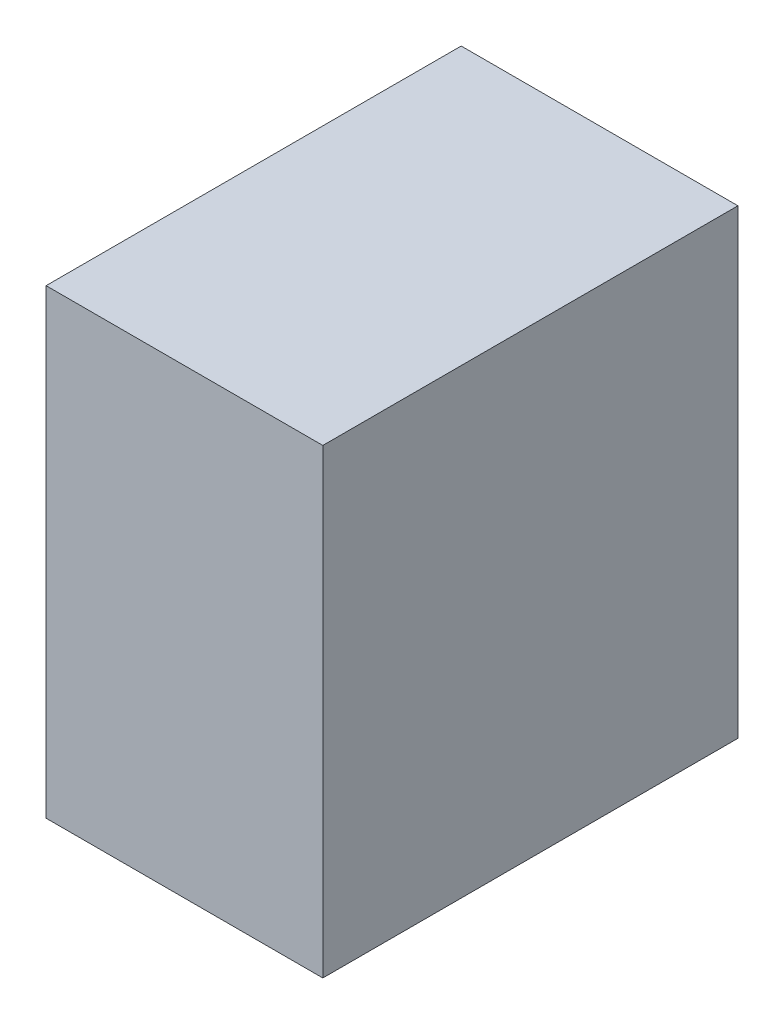
ISO-10303-21;
HEADER;
FILE_DESCRIPTION(('STEP AP214'),'2;1');
FILE_NAME('part.step','',(''),(''),'','','');
FILE_SCHEMA(('AUTOMOTIVE_DESIGN { 1 0 10303 214 1 1 1 1 }'));
ENDSEC;
DATA;
#1=APPLICATION_CONTEXT('core data for automotive mechanical design processes');
#2=APPLICATION_PROTOCOL_DEFINITION('international standard','automotive_design',2000,#1);
#3=PRODUCT_CONTEXT('',#1,'mechanical');
#4=PRODUCT('Part','Part','',(#3));
#5=PRODUCT_RELATED_PRODUCT_CATEGORY('part','',(#4));
#6=PRODUCT_DEFINITION_FORMATION('','',#4);
#7=PRODUCT_DEFINITION_CONTEXT('part definition',#1,'design');
#8=PRODUCT_DEFINITION('design','',#6,#7);
#9=PRODUCT_DEFINITION_SHAPE('','',#8);
#10=(LENGTH_UNIT() NAMED_UNIT(*) SI_UNIT(.MILLI.,.METRE.));
#11=(NAMED_UNIT(*) PLANE_ANGLE_UNIT() SI_UNIT($,.RADIAN.));
#12=(NAMED_UNIT(*) SI_UNIT($,.STERADIAN.) SOLID_ANGLE_UNIT());
#13=UNCERTAINTY_MEASURE_WITH_UNIT(LENGTH_MEASURE(1.E-05),#10,'distance_accuracy_value','');
#14=(GEOMETRIC_REPRESENTATION_CONTEXT(3) GLOBAL_UNCERTAINTY_ASSIGNED_CONTEXT((#13)) GLOBAL_UNIT_ASSIGNED_CONTEXT((#10,
#11,#12)) REPRESENTATION_CONTEXT('',''));
#15=CARTESIAN_POINT('',(0.,0.,0.));
#16=DIRECTION('',(0.,0.,1.));
#17=DIRECTION('',(1.,0.,0.));
#18=AXIS2_PLACEMENT_3D('',#15,#16,#17);
#19=CARTESIAN_POINT('',(-3.29999987760815,0.700000362802523,-3.30112145980015));
#20=DIRECTION('',(1.,-1.74845553146952E-07,0.));
#21=DIRECTION('',(1.74845553146952E-07,1.,8.74227765734759E-08));
#22=AXIS2_PLACEMENT_3D('',#19,#20,#21);
#23=PLANE('',#22);
#24=DIRECTION('',(0.,8.7422776672162E-08,-0.999999999999996));
#25=VECTOR('',#24,1.);
#26=CARTESIAN_POINT('',(-3.29999986886589,0.750000279750885,-2.35112145542901));
#27=LINE('',#26,#25);
#28=CARTESIAN_POINT('',(-3.29999986886689,0.750000279750885,-2.35112145543001));
#29=VERTEX_POINT('',#28);
#30=CARTESIAN_POINT('',(-3.29999986886687,0.750000358432384,-3.25112145542901));
#31=VERTEX_POINT('',#30);
#32=EDGE_CURVE('E11',#29,#31,#27,.T.);
#33=ORIENTED_EDGE('',*,*,#32,.T.);
#34=DIRECTION('',(1.74845553146599E-07,0.999999999999981,8.74227765732993E-08));
#35=VECTOR('',#34,1.);
#36=CARTESIAN_POINT('',(-3.29999986886587,0.750000358431384,-3.25112145542901));
#37=LINE('',#36,#35);
#38=CARTESIAN_POINT('',(-3.29999969402132,1.75000035843338,-3.25112136800523));
#39=VERTEX_POINT('',#38);
#40=EDGE_CURVE('E69',#31,#39,#37,.T.);
#41=ORIENTED_EDGE('',*,*,#40,.T.);
#42=DIRECTION('',(0.,-8.7422776672162E-08,0.999999999999996));
#43=VECTOR('',#42,1.);
#44=CARTESIAN_POINT('',(-3.29999969402032,1.75000035843338,-3.25112136800623));
#45=LINE('',#44,#43);
#46=CARTESIAN_POINT('',(-3.29999969402133,1.75000027975188,-2.35112136800623));
#47=VERTEX_POINT('',#46);
#48=EDGE_CURVE('E55',#39,#47,#45,.T.);
#49=ORIENTED_EDGE('',*,*,#48,.T.);
#50=DIRECTION('',(-1.74845553146599E-07,-0.999999999999981,-8.74227765732993E-08));
#51=VECTOR('',#50,1.);
#52=CARTESIAN_POINT('',(-3.29999969402033,1.75000027975289,-2.35112136800624));
#53=LINE('',#52,#51);
#54=EDGE_CURVE('E53',#47,#29,#53,.T.);
#55=ORIENTED_EDGE('',*,*,#54,.T.);
#56=EDGE_LOOP('',(#33,#41,#49,#55));
#57=FACE_BOUND('',#56,.T.);
#58=ADVANCED_FACE('F17',(#57),#23,.T.);
#59=CARTESIAN_POINT('',(-3.89999987760815,0.700000467709855,-3.30112145980015));
#60=DIRECTION('',(1.,-1.74845553146952E-07,0.));
#61=DIRECTION('',(1.74845553146952E-07,1.,8.74227765734759E-08));
#62=AXIS2_PLACEMENT_3D('',#59,#60,#61);
#63=PLANE('',#62);
#64=DIRECTION('',(-1.74845553146599E-07,-0.999999999999981,-8.74227765732993E-08));
#65=VECTOR('',#64,1.);
#66=CARTESIAN_POINT('',(-3.89999969402033,1.75000038466022,-2.35112136800623));
#67=LINE('',#66,#65);
#68=CARTESIAN_POINT('',(-3.89999969401933,1.75000038465922,-2.35112136800623));
#69=VERTEX_POINT('',#68);
#70=CARTESIAN_POINT('',(-3.89999986886489,0.750000384658217,-2.35112145543001));
#71=VERTEX_POINT('',#70);
#72=EDGE_CURVE('E24',#69,#71,#67,.T.);
#73=ORIENTED_EDGE('',*,*,#72,.F.);
#74=DIRECTION('',(0.,-8.7422776672162E-08,0.999999999999996));
#75=VECTOR('',#74,1.);
#76=CARTESIAN_POINT('',(-3.89999969402032,1.75000046334072,-3.25112136800623));
#77=LINE('',#76,#75);
#78=CARTESIAN_POINT('',(-3.89999969401932,1.75000046334072,-3.25112136800523));
#79=VERTEX_POINT('',#78);
#80=EDGE_CURVE('E70',#79,#69,#77,.T.);
#81=ORIENTED_EDGE('',*,*,#80,.F.);
#82=DIRECTION('',(1.74845553146599E-07,0.999999999999981,8.74227765732993E-08));
#83=VECTOR('',#82,1.);
#84=CARTESIAN_POINT('',(-3.89999986886587,0.750000463338716,-3.25112145542901));
#85=LINE('',#84,#83);
#86=CARTESIAN_POINT('',(-3.89999986886487,0.750000463339716,-3.25112145542901));
#87=VERTEX_POINT('',#86);
#88=EDGE_CURVE('E59',#87,#79,#85,.T.);
#89=ORIENTED_EDGE('',*,*,#88,.F.);
#90=DIRECTION('',(0.,8.74227765488039E-08,-0.999999999999996));
#91=VECTOR('',#90,1.);
#92=CARTESIAN_POINT('',(-3.89999986886589,0.750000384658217,-2.35112145542901));
#93=LINE('',#92,#91);
#94=EDGE_CURVE('E78',#71,#87,#93,.T.);
#95=ORIENTED_EDGE('',*,*,#94,.F.);
#96=EDGE_LOOP('',(#73,#81,#89,#95));
#97=FACE_BOUND('',#96,.T.);
#98=ADVANCED_FACE('F89',(#97),#63,.F.);
#99=CARTESIAN_POINT('',(-3.29999986886589,0.750000279750885,-2.35112145542901));
#100=DIRECTION('',(1.74845553146952E-07,1.,8.74227765734759E-08));
#101=DIRECTION('',(0.,8.74227765734759E-08,-1.));
#102=AXIS2_PLACEMENT_3D('',#99,#100,#101);
#103=PLANE('',#102);
#104=DIRECTION('',(-0.999999999999985,1.74845553220964E-07,0.));
#105=VECTOR('',#104,1.);
#106=CARTESIAN_POINT('',(-3.29999986886589,0.750000279750885,-2.35112145542901));
#107=LINE('',#106,#105);
#108=EDGE_CURVE('E65',#29,#71,#107,.T.);
#109=ORIENTED_EDGE('',*,*,#108,.T.);
#110=ORIENTED_EDGE('',*,*,#94,.T.);
#111=DIRECTION('',(-0.999999999999985,1.74845553220964E-07,0.));
#112=VECTOR('',#111,1.);
#113=CARTESIAN_POINT('',(-3.29999986886587,0.750000358431384,-3.25112145542901));
#114=LINE('',#113,#112);
#115=EDGE_CURVE('E66',#31,#87,#114,.T.);
#116=ORIENTED_EDGE('',*,*,#115,.F.);
#117=ORIENTED_EDGE('',*,*,#32,.F.);
#118=EDGE_LOOP('',(#109,#110,#116,#117));
#119=FACE_BOUND('',#118,.T.);
#120=ADVANCED_FACE('F63',(#119),#103,.F.);
#121=CARTESIAN_POINT('',(-3.29999986886587,0.750000358431384,-3.25112145542901));
#122=DIRECTION('',(0.,-8.74227765734759E-08,1.));
#123=DIRECTION('',(1.74845553146952E-07,1.,8.74227765734759E-08));
#124=AXIS2_PLACEMENT_3D('',#121,#122,#123);
#125=PLANE('',#124);
#126=ORIENTED_EDGE('',*,*,#115,.T.);
#127=ORIENTED_EDGE('',*,*,#88,.T.);
#128=DIRECTION('',(-0.999999999999985,1.74845553220964E-07,0.));
#129=VECTOR('',#128,1.);
#130=CARTESIAN_POINT('',(-3.29999969402032,1.75000035843338,-3.25112136800623));
#131=LINE('',#130,#129);
#132=EDGE_CURVE('E60',#39,#79,#131,.T.);
#133=ORIENTED_EDGE('',*,*,#132,.F.);
#134=ORIENTED_EDGE('',*,*,#40,.F.);
#135=EDGE_LOOP('',(#126,#127,#133,#134));
#136=FACE_BOUND('',#135,.T.);
#137=ADVANCED_FACE('F91',(#136),#125,.F.);
#138=CARTESIAN_POINT('',(-3.29999969402032,1.75000035843338,-3.25112136800623));
#139=DIRECTION('',(-1.74845553146952E-07,-1.,-8.74227765734759E-08));
#140=DIRECTION('',(0.,-8.74227765734759E-08,1.));
#141=AXIS2_PLACEMENT_3D('',#138,#139,#140);
#142=PLANE('',#141);
#143=ORIENTED_EDGE('',*,*,#132,.T.);
#144=ORIENTED_EDGE('',*,*,#80,.T.);
#145=DIRECTION('',(-0.999999999999985,1.74845553220964E-07,0.));
#146=VECTOR('',#145,1.);
#147=CARTESIAN_POINT('',(-3.29999969402033,1.75000027975288,-2.35112136800623));
#148=LINE('',#147,#146);
#149=EDGE_CURVE('E84',#47,#69,#148,.T.);
#150=ORIENTED_EDGE('',*,*,#149,.F.);
#151=ORIENTED_EDGE('',*,*,#48,.F.);
#152=EDGE_LOOP('',(#143,#144,#150,#151));
#153=FACE_BOUND('',#152,.T.);
#154=ADVANCED_FACE('F86',(#153),#142,.F.);
#155=CARTESIAN_POINT('',(-3.29999969402033,1.75000027975288,-2.35112136800623));
#156=DIRECTION('',(0.,8.74227765734759E-08,-1.));
#157=DIRECTION('',(-1.74845553146952E-07,-1.,-8.74227765734759E-08));
#158=AXIS2_PLACEMENT_3D('',#155,#156,#157);
#159=PLANE('',#158);
#160=ORIENTED_EDGE('',*,*,#149,.T.);
#161=ORIENTED_EDGE('',*,*,#72,.T.);
#162=ORIENTED_EDGE('',*,*,#108,.F.);
#163=ORIENTED_EDGE('',*,*,#54,.F.);
#164=EDGE_LOOP('',(#160,#161,#162,#163));
#165=FACE_BOUND('',#164,.T.);
#166=ADVANCED_FACE('F68',(#165),#159,.F.);
#167=CLOSED_SHELL('',(#58,#98,#120,#137,#154,#166));
#168=MANIFOLD_SOLID_BREP('B1',#167);
#169=ADVANCED_BREP_SHAPE_REPRESENTATION('',(#18,#168),#14);
#170=SHAPE_DEFINITION_REPRESENTATION(#9,#169);
ENDSEC;
END-ISO-10303-21;
